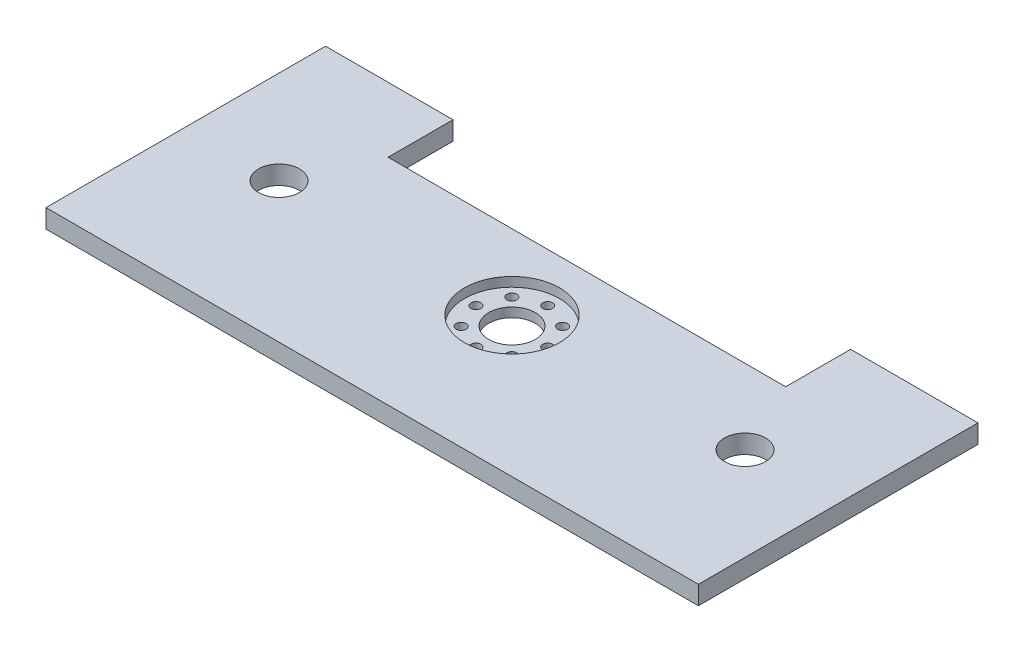
ISO-10303-21;
HEADER;
FILE_DESCRIPTION(('STEP AP214'),'2;1');
FILE_NAME('part.step','',(''),(''),'','','');
FILE_SCHEMA(('AUTOMOTIVE_DESIGN { 1 0 10303 214 1 1 1 1 }'));
ENDSEC;
DATA;
#1=APPLICATION_CONTEXT('core data for automotive mechanical design processes');
#2=APPLICATION_PROTOCOL_DEFINITION('international standard','automotive_design',2000,#1);
#3=PRODUCT_CONTEXT('',#1,'mechanical');
#4=PRODUCT('Part','Part','',(#3));
#5=PRODUCT_RELATED_PRODUCT_CATEGORY('part','',(#4));
#6=PRODUCT_DEFINITION_FORMATION('','',#4);
#7=PRODUCT_DEFINITION_CONTEXT('part definition',#1,'design');
#8=PRODUCT_DEFINITION('design','',#6,#7);
#9=PRODUCT_DEFINITION_SHAPE('','',#8);
#10=(LENGTH_UNIT() NAMED_UNIT(*) SI_UNIT(.MILLI.,.METRE.));
#11=(NAMED_UNIT(*) PLANE_ANGLE_UNIT() SI_UNIT($,.RADIAN.));
#12=(NAMED_UNIT(*) SI_UNIT($,.STERADIAN.) SOLID_ANGLE_UNIT());
#13=UNCERTAINTY_MEASURE_WITH_UNIT(LENGTH_MEASURE(1.E-05),#10,'distance_accuracy_value','');
#14=(GEOMETRIC_REPRESENTATION_CONTEXT(3) GLOBAL_UNCERTAINTY_ASSIGNED_CONTEXT((#13)) GLOBAL_UNIT_ASSIGNED_CONTEXT((#10,
#11,#12)) REPRESENTATION_CONTEXT('',''));
#15=CARTESIAN_POINT('',(0.,0.,0.));
#16=DIRECTION('',(0.,0.,1.));
#17=DIRECTION('',(1.,0.,0.));
#18=AXIS2_PLACEMENT_3D('',#15,#16,#17);
#19=CARTESIAN_POINT('',(0.,5.08,0.));
#20=DIRECTION('',(0.,1.,0.));
#21=DIRECTION('',(0.,0.,1.));
#22=AXIS2_PLACEMENT_3D('',#19,#20,#21);
#23=PLANE('',#22);
#24=CARTESIAN_POINT('',(0.,5.08,0.));
#25=DIRECTION('',(0.,1.,0.));
#26=DIRECTION('',(0.,0.,1.));
#27=AXIS2_PLACEMENT_3D('',#24,#25,#26);
#28=CIRCLE('',#27,12.954);
#29=CARTESIAN_POINT('',(0.,5.08,12.954));
#30=VERTEX_POINT('',#29);
#31=EDGE_CURVE('E196',#30,#30,#28,.T.);
#32=ORIENTED_EDGE('',*,*,#31,.F.);
#33=EDGE_LOOP('',(#32));
#34=FACE_BOUND('',#33,.T.);
#35=CARTESIAN_POINT('',(-63.5,5.08,0.));
#36=DIRECTION('',(0.,1.,0.));
#37=DIRECTION('',(0.,0.,1.));
#38=AXIS2_PLACEMENT_3D('',#35,#36,#37);
#39=CIRCLE('',#38,5.58799999999999);
#40=CARTESIAN_POINT('',(-63.5,5.08,5.58799999999999));
#41=VERTEX_POINT('',#40);
#42=EDGE_CURVE('E205',#41,#41,#39,.T.);
#43=ORIENTED_EDGE('',*,*,#42,.F.);
#44=EDGE_LOOP('',(#43));
#45=FACE_BOUND('',#44,.T.);
#46=CARTESIAN_POINT('',(63.5,5.08,0.));
#47=DIRECTION('',(0.,1.,0.));
#48=DIRECTION('',(0.,0.,1.));
#49=AXIS2_PLACEMENT_3D('',#46,#47,#48);
#50=CIRCLE('',#49,5.58799999999999);
#51=CARTESIAN_POINT('',(63.5,5.08,5.58799999999999));
#52=VERTEX_POINT('',#51);
#53=EDGE_CURVE('E199',#52,#52,#50,.T.);
#54=ORIENTED_EDGE('',*,*,#53,.F.);
#55=EDGE_LOOP('',(#54));
#56=FACE_BOUND('',#55,.T.);
#57=DIRECTION('',(1.,0.,0.));
#58=VECTOR('',#57,1.);
#59=CARTESIAN_POINT('',(54.1798398861406,5.08,-20.408634654288));
#60=LINE('',#59,#58);
#61=CARTESIAN_POINT('',(-54.1798398861406,5.08,-20.408634654288));
#62=VERTEX_POINT('',#61);
#63=CARTESIAN_POINT('',(54.1798398861406,5.08,-20.408634654288));
#64=VERTEX_POINT('',#63);
#65=EDGE_CURVE('E120',#62,#64,#60,.T.);
#66=ORIENTED_EDGE('',*,*,#65,.F.);
#67=DIRECTION('',(0.,0.,1.));
#68=VECTOR('',#67,1.);
#69=CARTESIAN_POINT('',(-54.1798398861406,5.08,-20.408634654288));
#70=LINE('',#69,#68);
#71=CARTESIAN_POINT('',(-54.1798398861406,5.08,-38.1));
#72=VERTEX_POINT('',#71);
#73=EDGE_CURVE('E111',#72,#62,#70,.T.);
#74=ORIENTED_EDGE('',*,*,#73,.F.);
#75=DIRECTION('',(-1.,0.,0.));
#76=VECTOR('',#75,1.);
#77=CARTESIAN_POINT('',(-88.9,5.08,-38.1));
#78=LINE('',#77,#76);
#79=CARTESIAN_POINT('',(-88.9,5.08,-38.1));
#80=VERTEX_POINT('',#79);
#81=EDGE_CURVE('E213',#72,#80,#78,.T.);
#82=ORIENTED_EDGE('',*,*,#81,.T.);
#83=DIRECTION('',(0.,0.,1.));
#84=VECTOR('',#83,1.);
#85=CARTESIAN_POINT('',(-88.9,5.08,-38.1));
#86=LINE('',#85,#84);
#87=CARTESIAN_POINT('',(-88.9,5.08,38.1));
#88=VERTEX_POINT('',#87);
#89=EDGE_CURVE('E215',#80,#88,#86,.T.);
#90=ORIENTED_EDGE('',*,*,#89,.T.);
#91=DIRECTION('',(1.,0.,0.));
#92=VECTOR('',#91,1.);
#93=CARTESIAN_POINT('',(-88.9,5.08,38.1));
#94=LINE('',#93,#92);
#95=CARTESIAN_POINT('',(88.9,5.08,38.1));
#96=VERTEX_POINT('',#95);
#97=EDGE_CURVE('E60',#88,#96,#94,.T.);
#98=ORIENTED_EDGE('',*,*,#97,.T.);
#99=DIRECTION('',(0.,0.,-1.));
#100=VECTOR('',#99,1.);
#101=CARTESIAN_POINT('',(88.9,5.08,-38.1));
#102=LINE('',#101,#100);
#103=CARTESIAN_POINT('',(88.9,5.08,-38.1));
#104=VERTEX_POINT('',#103);
#105=EDGE_CURVE('E211',#96,#104,#102,.T.);
#106=ORIENTED_EDGE('',*,*,#105,.T.);
#107=CARTESIAN_POINT('',(54.1798398861406,5.08,-38.1));
#108=VERTEX_POINT('',#107);
#109=EDGE_CURVE('E87',#104,#108,#78,.T.);
#110=ORIENTED_EDGE('',*,*,#109,.T.);
#111=DIRECTION('',(0.,0.,-1.));
#112=VECTOR('',#111,1.);
#113=CARTESIAN_POINT('',(54.1798398861406,5.08,-20.408634654288));
#114=LINE('',#113,#112);
#115=EDGE_CURVE('E51',#64,#108,#114,.T.);
#116=ORIENTED_EDGE('',*,*,#115,.F.);
#117=EDGE_LOOP('',(#66,#74,#82,#90,#98,#106,#110,#116));
#118=FACE_BOUND('',#117,.T.);
#119=ADVANCED_FACE('F35',(#34,#45,#56,#118),#23,.T.);
#120=CARTESIAN_POINT('',(0.,0.,0.));
#121=DIRECTION('',(0.,1.,0.));
#122=DIRECTION('',(0.,0.,1.));
#123=AXIS2_PLACEMENT_3D('',#120,#121,#122);
#124=PLANE('',#123);
#125=CARTESIAN_POINT('',(63.5,0.,0.));
#126=DIRECTION('',(0.,1.,0.));
#127=DIRECTION('',(0.,0.,1.));
#128=AXIS2_PLACEMENT_3D('',#125,#126,#127);
#129=CIRCLE('',#128,5.58799999999999);
#130=CARTESIAN_POINT('',(63.5,0.,5.58799999999999));
#131=VERTEX_POINT('',#130);
#132=EDGE_CURVE('E195',#131,#131,#129,.T.);
#133=ORIENTED_EDGE('',*,*,#132,.T.);
#134=EDGE_LOOP('',(#133));
#135=FACE_BOUND('',#134,.T.);
#136=CARTESIAN_POINT('',(-63.5,0.,0.));
#137=DIRECTION('',(0.,1.,0.));
#138=DIRECTION('',(0.,0.,1.));
#139=AXIS2_PLACEMENT_3D('',#136,#137,#138);
#140=CIRCLE('',#139,5.58799999999999);
#141=CARTESIAN_POINT('',(-63.5,0.,5.58799999999999));
#142=VERTEX_POINT('',#141);
#143=EDGE_CURVE('E202',#142,#142,#140,.T.);
#144=ORIENTED_EDGE('',*,*,#143,.T.);
#145=EDGE_LOOP('',(#144));
#146=FACE_BOUND('',#145,.T.);
#147=CARTESIAN_POINT('',(0.,0.,0.));
#148=DIRECTION('',(0.,1.,0.));
#149=DIRECTION('',(0.,0.,1.));
#150=AXIS2_PLACEMENT_3D('',#147,#148,#149);
#151=CIRCLE('',#150,6.35);
#152=CARTESIAN_POINT('',(0.,0.,6.35));
#153=VERTEX_POINT('',#152);
#154=EDGE_CURVE('E189',#153,#153,#151,.T.);
#155=ORIENTED_EDGE('',*,*,#154,.T.);
#156=EDGE_LOOP('',(#155));
#157=FACE_BOUND('',#156,.T.);
#158=CARTESIAN_POINT('',(0.0657403354153976,0.,9.88724751288396));
#159=DIRECTION('',(0.,1.,0.));
#160=DIRECTION('',(0.,0.,1.));
#161=AXIS2_PLACEMENT_3D('',#158,#159,#160);
#162=CIRCLE('',#161,1.35254999999999);
#163=CARTESIAN_POINT('',(0.0657403354153976,0.,11.2397975128839));
#164=VERTEX_POINT('',#163);
#165=EDGE_CURVE('E186',#164,#164,#162,.T.);
#166=ORIENTED_EDGE('',*,*,#165,.T.);
#167=EDGE_LOOP('',(#166));
#168=FACE_BOUND('',#167,.T.);
#169=CARTESIAN_POINT('',(-6.84905687780786,0.,7.0230447261072));
#170=DIRECTION('',(0.,1.,0.));
#171=DIRECTION('',(0.,0.,1.));
#172=AXIS2_PLACEMENT_3D('',#169,#170,#171);
#173=CIRCLE('',#172,1.35254999999999);
#174=CARTESIAN_POINT('',(-6.84905687780786,0.,8.37559472610719));
#175=VERTEX_POINT('',#174);
#176=EDGE_CURVE('E180',#175,#175,#173,.T.);
#177=ORIENTED_EDGE('',*,*,#176,.T.);
#178=EDGE_LOOP('',(#177));
#179=FACE_BOUND('',#178,.T.);
#180=CARTESIAN_POINT('',(-9.7132596645846,0.,0.108247512883929));
#181=DIRECTION('',(0.,1.,0.));
#182=DIRECTION('',(0.,0.,1.));
#183=AXIS2_PLACEMENT_3D('',#180,#181,#182);
#184=CIRCLE('',#183,1.35254999999999);
#185=CARTESIAN_POINT('',(-9.7132596645846,0.,1.46079751288392));
#186=VERTEX_POINT('',#185);
#187=EDGE_CURVE('E174',#186,#186,#184,.T.);
#188=ORIENTED_EDGE('',*,*,#187,.T.);
#189=EDGE_LOOP('',(#188));
#190=FACE_BOUND('',#189,.T.);
#191=CARTESIAN_POINT('',(-6.84905687780781,0.,-6.80654970033932));
#192=DIRECTION('',(0.,1.,0.));
#193=DIRECTION('',(0.,0.,1.));
#194=AXIS2_PLACEMENT_3D('',#191,#192,#193);
#195=CIRCLE('',#194,1.35254999999999);
#196=CARTESIAN_POINT('',(-6.84905687780781,0.,-5.45399970033933));
#197=VERTEX_POINT('',#196);
#198=EDGE_CURVE('E168',#197,#197,#195,.T.);
#199=ORIENTED_EDGE('',*,*,#198,.T.);
#200=EDGE_LOOP('',(#199));
#201=FACE_BOUND('',#200,.T.);
#202=CARTESIAN_POINT('',(0.0657403354154661,0.,-9.67075248711604));
#203=DIRECTION('',(0.,1.,0.));
#204=DIRECTION('',(0.,0.,1.));
#205=AXIS2_PLACEMENT_3D('',#202,#203,#204);
#206=CIRCLE('',#205,1.35254999999999);
#207=CARTESIAN_POINT('',(0.0657403354154661,0.,-8.31820248711605));
#208=VERTEX_POINT('',#207);
#209=EDGE_CURVE('E162',#208,#208,#206,.T.);
#210=ORIENTED_EDGE('',*,*,#209,.T.);
#211=EDGE_LOOP('',(#210));
#212=FACE_BOUND('',#211,.T.);
#213=CARTESIAN_POINT('',(6.98053754863856,0.,7.02304472610729));
#214=DIRECTION('',(0.,1.,0.));
#215=DIRECTION('',(0.,0.,1.));
#216=AXIS2_PLACEMENT_3D('',#213,#214,#215);
#217=CIRCLE('',#216,1.35254999999999);
#218=CARTESIAN_POINT('',(6.98053754863856,0.,8.37559472610728));
#219=VERTEX_POINT('',#218);
#220=EDGE_CURVE('E156',#219,#219,#217,.T.);
#221=ORIENTED_EDGE('',*,*,#220,.T.);
#222=EDGE_LOOP('',(#221));
#223=FACE_BOUND('',#222,.T.);
#224=CARTESIAN_POINT('',(9.8447403354154,0.,0.108247512884066));
#225=DIRECTION('',(0.,1.,0.));
#226=DIRECTION('',(0.,0.,1.));
#227=AXIS2_PLACEMENT_3D('',#224,#225,#226);
#228=CIRCLE('',#227,1.35254999999999);
#229=CARTESIAN_POINT('',(9.8447403354154,0.,1.46079751288405));
#230=VERTEX_POINT('',#229);
#231=EDGE_CURVE('E150',#230,#230,#228,.T.);
#232=ORIENTED_EDGE('',*,*,#231,.T.);
#233=EDGE_LOOP('',(#232));
#234=FACE_BOUND('',#233,.T.);
#235=CARTESIAN_POINT('',(6.98053754863871,0.,-6.80654970033923));
#236=DIRECTION('',(0.,1.,0.));
#237=DIRECTION('',(0.,0.,1.));
#238=AXIS2_PLACEMENT_3D('',#235,#236,#237);
#239=CIRCLE('',#238,1.35254999999999);
#240=CARTESIAN_POINT('',(6.98053754863871,0.,-5.45399970033924));
#241=VERTEX_POINT('',#240);
#242=EDGE_CURVE('E144',#241,#241,#239,.T.);
#243=ORIENTED_EDGE('',*,*,#242,.T.);
#244=EDGE_LOOP('',(#243));
#245=FACE_BOUND('',#244,.T.);
#246=DIRECTION('',(0.,0.,1.));
#247=VECTOR('',#246,1.);
#248=CARTESIAN_POINT('',(-54.1798398861406,0.,-20.408634654288));
#249=LINE('',#248,#247);
#250=CARTESIAN_POINT('',(-54.1798398861406,0.,-38.1));
#251=VERTEX_POINT('',#250);
#252=CARTESIAN_POINT('',(-54.1798398861406,0.,-20.408634654288));
#253=VERTEX_POINT('',#252);
#254=EDGE_CURVE('E133',#251,#253,#249,.T.);
#255=ORIENTED_EDGE('',*,*,#254,.T.);
#256=DIRECTION('',(1.,0.,0.));
#257=VECTOR('',#256,1.);
#258=CARTESIAN_POINT('',(54.1798398861406,0.,-20.408634654288));
#259=LINE('',#258,#257);
#260=CARTESIAN_POINT('',(54.1798398861406,0.,-20.408634654288));
#261=VERTEX_POINT('',#260);
#262=EDGE_CURVE('E126',#253,#261,#259,.T.);
#263=ORIENTED_EDGE('',*,*,#262,.T.);
#264=DIRECTION('',(0.,0.,-1.));
#265=VECTOR('',#264,1.);
#266=CARTESIAN_POINT('',(54.1798398861406,0.,-20.408634654288));
#267=LINE('',#266,#265);
#268=CARTESIAN_POINT('',(54.1798398861406,0.,-38.1));
#269=VERTEX_POINT('',#268);
#270=EDGE_CURVE('E121',#261,#269,#267,.T.);
#271=ORIENTED_EDGE('',*,*,#270,.T.);
#272=DIRECTION('',(-1.,0.,0.));
#273=VECTOR('',#272,1.);
#274=CARTESIAN_POINT('',(-88.9,0.,-38.1));
#275=LINE('',#274,#273);
#276=CARTESIAN_POINT('',(88.9,0.,-38.1));
#277=VERTEX_POINT('',#276);
#278=EDGE_CURVE('E222',#277,#269,#275,.T.);
#279=ORIENTED_EDGE('',*,*,#278,.F.);
#280=DIRECTION('',(0.,0.,-1.));
#281=VECTOR('',#280,1.);
#282=CARTESIAN_POINT('',(88.9,0.,-38.1));
#283=LINE('',#282,#281);
#284=CARTESIAN_POINT('',(88.9,0.,38.1));
#285=VERTEX_POINT('',#284);
#286=EDGE_CURVE('E208',#285,#277,#283,.T.);
#287=ORIENTED_EDGE('',*,*,#286,.F.);
#288=DIRECTION('',(1.,0.,0.));
#289=VECTOR('',#288,1.);
#290=CARTESIAN_POINT('',(-88.9,0.,38.1));
#291=LINE('',#290,#289);
#292=CARTESIAN_POINT('',(-88.9,0.,38.1));
#293=VERTEX_POINT('',#292);
#294=EDGE_CURVE('E81',#293,#285,#291,.T.);
#295=ORIENTED_EDGE('',*,*,#294,.F.);
#296=DIRECTION('',(0.,0.,1.));
#297=VECTOR('',#296,1.);
#298=CARTESIAN_POINT('',(-88.9,0.,-38.1));
#299=LINE('',#298,#297);
#300=CARTESIAN_POINT('',(-88.9,0.,-38.1));
#301=VERTEX_POINT('',#300);
#302=EDGE_CURVE('E225',#301,#293,#299,.T.);
#303=ORIENTED_EDGE('',*,*,#302,.F.);
#304=EDGE_CURVE('E221',#251,#301,#275,.T.);
#305=ORIENTED_EDGE('',*,*,#304,.F.);
#306=EDGE_LOOP('',(#255,#263,#271,#279,#287,#295,#303,#305));
#307=FACE_BOUND('',#306,.T.);
#308=ADVANCED_FACE('F241',(#135,#146,#157,#168,#179,#190,#201,#212,#223,#234,#245,#307),#124,.F.);
#309=CARTESIAN_POINT('',(-88.9,5.08,-38.1));
#310=DIRECTION('',(0.,0.,1.));
#311=DIRECTION('',(1.,0.,0.));
#312=AXIS2_PLACEMENT_3D('',#309,#310,#311);
#313=PLANE('',#312);
#314=DIRECTION('',(0.,-1.,0.));
#315=VECTOR('',#314,1.);
#316=CARTESIAN_POINT('',(-54.1798398861406,5.08,-38.1));
#317=LINE('',#316,#315);
#318=EDGE_CURVE('E117',#72,#251,#317,.T.);
#319=ORIENTED_EDGE('',*,*,#318,.T.);
#320=ORIENTED_EDGE('',*,*,#304,.T.);
#321=DIRECTION('',(0.,-1.,0.));
#322=VECTOR('',#321,1.);
#323=CARTESIAN_POINT('',(-88.9,5.08,-38.1));
#324=LINE('',#323,#322);
#325=EDGE_CURVE('E44',#80,#301,#324,.T.);
#326=ORIENTED_EDGE('',*,*,#325,.F.);
#327=ORIENTED_EDGE('',*,*,#81,.F.);
#328=EDGE_LOOP('',(#319,#320,#326,#327));
#329=FACE_BOUND('',#328,.T.);
#330=ADVANCED_FACE('F265',(#329),#313,.F.);
#331=DIRECTION('',(0.,-1.,0.));
#332=VECTOR('',#331,1.);
#333=CARTESIAN_POINT('',(54.1798398861406,5.08,-38.1));
#334=LINE('',#333,#332);
#335=EDGE_CURVE('E139',#108,#269,#334,.T.);
#336=ORIENTED_EDGE('',*,*,#335,.F.);
#337=ORIENTED_EDGE('',*,*,#109,.F.);
#338=DIRECTION('',(0.,-1.,0.));
#339=VECTOR('',#338,1.);
#340=CARTESIAN_POINT('',(88.9,5.08,-38.1));
#341=LINE('',#340,#339);
#342=EDGE_CURVE('E11',#104,#277,#341,.T.);
#343=ORIENTED_EDGE('',*,*,#342,.T.);
#344=ORIENTED_EDGE('',*,*,#278,.T.);
#345=EDGE_LOOP('',(#336,#337,#343,#344));
#346=FACE_BOUND('',#345,.T.);
#347=ADVANCED_FACE('F327',(#346),#313,.F.);
#348=CARTESIAN_POINT('',(88.9,5.08,-38.1));
#349=DIRECTION('',(-1.,0.,0.));
#350=DIRECTION('',(0.,0.,1.));
#351=AXIS2_PLACEMENT_3D('',#348,#349,#350);
#352=PLANE('',#351);
#353=ORIENTED_EDGE('',*,*,#286,.T.);
#354=ORIENTED_EDGE('',*,*,#342,.F.);
#355=ORIENTED_EDGE('',*,*,#105,.F.);
#356=DIRECTION('',(0.,-1.,0.));
#357=VECTOR('',#356,1.);
#358=CARTESIAN_POINT('',(88.9,5.08,38.1));
#359=LINE('',#358,#357);
#360=EDGE_CURVE('E218',#96,#285,#359,.T.);
#361=ORIENTED_EDGE('',*,*,#360,.T.);
#362=EDGE_LOOP('',(#353,#354,#355,#361));
#363=FACE_BOUND('',#362,.T.);
#364=ADVANCED_FACE('F37',(#363),#352,.F.);
#365=CARTESIAN_POINT('',(-88.9,5.08,-38.1));
#366=DIRECTION('',(1.,0.,0.));
#367=DIRECTION('',(0.,0.,-1.));
#368=AXIS2_PLACEMENT_3D('',#365,#366,#367);
#369=PLANE('',#368);
#370=ORIENTED_EDGE('',*,*,#302,.T.);
#371=DIRECTION('',(0.,-1.,0.));
#372=VECTOR('',#371,1.);
#373=CARTESIAN_POINT('',(-88.9,5.08,38.1));
#374=LINE('',#373,#372);
#375=EDGE_CURVE('E229',#88,#293,#374,.T.);
#376=ORIENTED_EDGE('',*,*,#375,.F.);
#377=ORIENTED_EDGE('',*,*,#89,.F.);
#378=ORIENTED_EDGE('',*,*,#325,.T.);
#379=EDGE_LOOP('',(#370,#376,#377,#378));
#380=FACE_BOUND('',#379,.T.);
#381=ADVANCED_FACE('F236',(#380),#369,.F.);
#382=CARTESIAN_POINT('',(-88.9,5.08,38.1));
#383=DIRECTION('',(0.,0.,-1.));
#384=DIRECTION('',(-1.,0.,0.));
#385=AXIS2_PLACEMENT_3D('',#382,#383,#384);
#386=PLANE('',#385);
#387=ORIENTED_EDGE('',*,*,#294,.T.);
#388=ORIENTED_EDGE('',*,*,#360,.F.);
#389=ORIENTED_EDGE('',*,*,#97,.F.);
#390=ORIENTED_EDGE('',*,*,#375,.T.);
#391=EDGE_LOOP('',(#387,#388,#389,#390));
#392=FACE_BOUND('',#391,.T.);
#393=ADVANCED_FACE('F246',(#392),#386,.F.);
#394=CARTESIAN_POINT('',(-63.5,5.08,0.));
#395=DIRECTION('',(0.,-1.,0.));
#396=DIRECTION('',(0.,0.,-1.));
#397=AXIS2_PLACEMENT_3D('',#394,#395,#396);
#398=CYLINDRICAL_SURFACE('',#397,5.58799999999999);
#399=ORIENTED_EDGE('',*,*,#42,.T.);
#400=EDGE_LOOP('',(#399));
#401=FACE_BOUND('',#400,.T.);
#402=ORIENTED_EDGE('',*,*,#143,.F.);
#403=EDGE_LOOP('',(#402));
#404=FACE_BOUND('',#403,.T.);
#405=ADVANCED_FACE('F248',(#401,#404),#398,.F.);
#406=CARTESIAN_POINT('',(63.5,5.08,0.));
#407=DIRECTION('',(0.,-1.,0.));
#408=DIRECTION('',(0.,0.,-1.));
#409=AXIS2_PLACEMENT_3D('',#406,#407,#408);
#410=CYLINDRICAL_SURFACE('',#409,5.58799999999999);
#411=ORIENTED_EDGE('',*,*,#53,.T.);
#412=EDGE_LOOP('',(#411));
#413=FACE_BOUND('',#412,.T.);
#414=ORIENTED_EDGE('',*,*,#132,.F.);
#415=EDGE_LOOP('',(#414));
#416=FACE_BOUND('',#415,.T.);
#417=ADVANCED_FACE('F254',(#413,#416),#410,.F.);
#418=CARTESIAN_POINT('',(0.,2.54,0.));
#419=DIRECTION('',(0.,1.,0.));
#420=DIRECTION('',(0.,0.,1.));
#421=AXIS2_PLACEMENT_3D('',#418,#419,#420);
#422=CYLINDRICAL_SURFACE('',#421,12.954);
#423=CARTESIAN_POINT('',(0.,2.54,0.));
#424=DIRECTION('',(0.,1.,0.));
#425=DIRECTION('',(0.,0.,1.));
#426=AXIS2_PLACEMENT_3D('',#423,#424,#425);
#427=CIRCLE('',#426,12.954);
#428=CARTESIAN_POINT('',(0.,2.54,12.954));
#429=VERTEX_POINT('',#428);
#430=EDGE_CURVE('E192',#429,#429,#427,.T.);
#431=ORIENTED_EDGE('',*,*,#430,.F.);
#432=EDGE_LOOP('',(#431));
#433=FACE_BOUND('',#432,.T.);
#434=ORIENTED_EDGE('',*,*,#31,.T.);
#435=EDGE_LOOP('',(#434));
#436=FACE_BOUND('',#435,.T.);
#437=ADVANCED_FACE('F272',(#433,#436),#422,.F.);
#438=CARTESIAN_POINT('',(0.,2.54,0.));
#439=DIRECTION('',(0.,1.,0.));
#440=DIRECTION('',(0.,0.,1.));
#441=AXIS2_PLACEMENT_3D('',#438,#439,#440);
#442=PLANE('',#441);
#443=CARTESIAN_POINT('',(6.98053754863871,2.54,-6.80654970033923));
#444=DIRECTION('',(0.,1.,0.));
#445=DIRECTION('',(0.,0.,1.));
#446=AXIS2_PLACEMENT_3D('',#443,#444,#445);
#447=CIRCLE('',#446,1.35254999999999);
#448=CARTESIAN_POINT('',(6.98053754863871,2.54,-5.45399970033924));
#449=VERTEX_POINT('',#448);
#450=EDGE_CURVE('E127',#449,#449,#447,.T.);
#451=ORIENTED_EDGE('',*,*,#450,.F.);
#452=EDGE_LOOP('',(#451));
#453=FACE_BOUND('',#452,.T.);
#454=CARTESIAN_POINT('',(9.8447403354154,2.54,0.108247512884066));
#455=DIRECTION('',(0.,1.,0.));
#456=DIRECTION('',(0.,0.,1.));
#457=AXIS2_PLACEMENT_3D('',#454,#455,#456);
#458=CIRCLE('',#457,1.35254999999999);
#459=CARTESIAN_POINT('',(9.8447403354154,2.54,1.46079751288405));
#460=VERTEX_POINT('',#459);
#461=EDGE_CURVE('E147',#460,#460,#458,.T.);
#462=ORIENTED_EDGE('',*,*,#461,.F.);
#463=EDGE_LOOP('',(#462));
#464=FACE_BOUND('',#463,.T.);
#465=CARTESIAN_POINT('',(6.98053754863856,2.54,7.02304472610729));
#466=DIRECTION('',(0.,1.,0.));
#467=DIRECTION('',(0.,0.,1.));
#468=AXIS2_PLACEMENT_3D('',#465,#466,#467);
#469=CIRCLE('',#468,1.35254999999999);
#470=CARTESIAN_POINT('',(6.98053754863856,2.54,8.37559472610728));
#471=VERTEX_POINT('',#470);
#472=EDGE_CURVE('E153',#471,#471,#469,.T.);
#473=ORIENTED_EDGE('',*,*,#472,.F.);
#474=EDGE_LOOP('',(#473));
#475=FACE_BOUND('',#474,.T.);
#476=CARTESIAN_POINT('',(0.0657403354154661,2.54,-9.67075248711604));
#477=DIRECTION('',(0.,1.,0.));
#478=DIRECTION('',(0.,0.,1.));
#479=AXIS2_PLACEMENT_3D('',#476,#477,#478);
#480=CIRCLE('',#479,1.35254999999999);
#481=CARTESIAN_POINT('',(0.0657403354154661,2.54,-8.31820248711605));
#482=VERTEX_POINT('',#481);
#483=EDGE_CURVE('E159',#482,#482,#480,.T.);
#484=ORIENTED_EDGE('',*,*,#483,.F.);
#485=EDGE_LOOP('',(#484));
#486=FACE_BOUND('',#485,.T.);
#487=CARTESIAN_POINT('',(-6.84905687780781,2.54,-6.80654970033932));
#488=DIRECTION('',(0.,1.,0.));
#489=DIRECTION('',(0.,0.,1.));
#490=AXIS2_PLACEMENT_3D('',#487,#488,#489);
#491=CIRCLE('',#490,1.35254999999999);
#492=CARTESIAN_POINT('',(-6.84905687780781,2.54,-5.45399970033933));
#493=VERTEX_POINT('',#492);
#494=EDGE_CURVE('E165',#493,#493,#491,.T.);
#495=ORIENTED_EDGE('',*,*,#494,.F.);
#496=EDGE_LOOP('',(#495));
#497=FACE_BOUND('',#496,.T.);
#498=CARTESIAN_POINT('',(-9.7132596645846,2.54,0.108247512883929));
#499=DIRECTION('',(0.,1.,0.));
#500=DIRECTION('',(0.,0.,1.));
#501=AXIS2_PLACEMENT_3D('',#498,#499,#500);
#502=CIRCLE('',#501,1.35254999999999);
#503=CARTESIAN_POINT('',(-9.7132596645846,2.54,1.46079751288392));
#504=VERTEX_POINT('',#503);
#505=EDGE_CURVE('E171',#504,#504,#502,.T.);
#506=ORIENTED_EDGE('',*,*,#505,.F.);
#507=EDGE_LOOP('',(#506));
#508=FACE_BOUND('',#507,.T.);
#509=CARTESIAN_POINT('',(-6.84905687780786,2.54,7.0230447261072));
#510=DIRECTION('',(0.,1.,0.));
#511=DIRECTION('',(0.,0.,1.));
#512=AXIS2_PLACEMENT_3D('',#509,#510,#511);
#513=CIRCLE('',#512,1.35254999999999);
#514=CARTESIAN_POINT('',(-6.84905687780786,2.54,8.37559472610719));
#515=VERTEX_POINT('',#514);
#516=EDGE_CURVE('E177',#515,#515,#513,.T.);
#517=ORIENTED_EDGE('',*,*,#516,.F.);
#518=EDGE_LOOP('',(#517));
#519=FACE_BOUND('',#518,.T.);
#520=CARTESIAN_POINT('',(0.0657403354153976,2.54,9.88724751288396));
#521=DIRECTION('',(0.,1.,0.));
#522=DIRECTION('',(0.,0.,1.));
#523=AXIS2_PLACEMENT_3D('',#520,#521,#522);
#524=CIRCLE('',#523,1.35254999999999);
#525=CARTESIAN_POINT('',(0.0657403354153976,2.54,11.2397975128839));
#526=VERTEX_POINT('',#525);
#527=EDGE_CURVE('E183',#526,#526,#524,.T.);
#528=ORIENTED_EDGE('',*,*,#527,.F.);
#529=EDGE_LOOP('',(#528));
#530=FACE_BOUND('',#529,.T.);
#531=CARTESIAN_POINT('',(0.,2.54,0.));
#532=DIRECTION('',(0.,1.,0.));
#533=DIRECTION('',(0.,0.,1.));
#534=AXIS2_PLACEMENT_3D('',#531,#532,#533);
#535=CIRCLE('',#534,6.35);
#536=CARTESIAN_POINT('',(0.,2.54,6.35));
#537=VERTEX_POINT('',#536);
#538=EDGE_CURVE('E39',#537,#537,#535,.T.);
#539=ORIENTED_EDGE('',*,*,#538,.F.);
#540=EDGE_LOOP('',(#539));
#541=FACE_BOUND('',#540,.T.);
#542=ORIENTED_EDGE('',*,*,#430,.T.);
#543=EDGE_LOOP('',(#542));
#544=FACE_BOUND('',#543,.T.);
#545=ADVANCED_FACE('F276',(#453,#464,#475,#486,#497,#508,#519,#530,#541,#544),#442,.T.);
#546=CARTESIAN_POINT('',(0.,0.,0.));
#547=DIRECTION('',(0.,1.,0.));
#548=DIRECTION('',(0.,0.,1.));
#549=AXIS2_PLACEMENT_3D('',#546,#547,#548);
#550=CYLINDRICAL_SURFACE('',#549,6.35);
#551=ORIENTED_EDGE('',*,*,#538,.T.);
#552=EDGE_LOOP('',(#551));
#553=FACE_BOUND('',#552,.T.);
#554=ORIENTED_EDGE('',*,*,#154,.F.);
#555=EDGE_LOOP('',(#554));
#556=FACE_BOUND('',#555,.T.);
#557=ADVANCED_FACE('F280',(#553,#556),#550,.F.);
#558=CARTESIAN_POINT('',(0.0657403354153976,2.54,9.88724751288396));
#559=DIRECTION('',(0.,1.,0.));
#560=DIRECTION('',(0.,0.,1.));
#561=AXIS2_PLACEMENT_3D('',#558,#559,#560);
#562=CYLINDRICAL_SURFACE('',#561,1.35254999999999);
#563=ORIENTED_EDGE('',*,*,#165,.F.);
#564=EDGE_LOOP('',(#563));
#565=FACE_BOUND('',#564,.T.);
#566=ORIENTED_EDGE('',*,*,#527,.T.);
#567=EDGE_LOOP('',(#566));
#568=FACE_BOUND('',#567,.T.);
#569=ADVANCED_FACE('F284',(#565,#568),#562,.F.);
#570=CARTESIAN_POINT('',(-6.84905687780786,2.54,7.0230447261072));
#571=DIRECTION('',(0.,1.,0.));
#572=DIRECTION('',(0.,0.,1.));
#573=AXIS2_PLACEMENT_3D('',#570,#571,#572);
#574=CYLINDRICAL_SURFACE('',#573,1.35254999999999);
#575=ORIENTED_EDGE('',*,*,#176,.F.);
#576=EDGE_LOOP('',(#575));
#577=FACE_BOUND('',#576,.T.);
#578=ORIENTED_EDGE('',*,*,#516,.T.);
#579=EDGE_LOOP('',(#578));
#580=FACE_BOUND('',#579,.T.);
#581=ADVANCED_FACE('F288',(#577,#580),#574,.F.);
#582=CARTESIAN_POINT('',(-9.7132596645846,2.54,0.108247512883929));
#583=DIRECTION('',(0.,1.,0.));
#584=DIRECTION('',(0.,0.,1.));
#585=AXIS2_PLACEMENT_3D('',#582,#583,#584);
#586=CYLINDRICAL_SURFACE('',#585,1.35254999999999);
#587=ORIENTED_EDGE('',*,*,#187,.F.);
#588=EDGE_LOOP('',(#587));
#589=FACE_BOUND('',#588,.T.);
#590=ORIENTED_EDGE('',*,*,#505,.T.);
#591=EDGE_LOOP('',(#590));
#592=FACE_BOUND('',#591,.T.);
#593=ADVANCED_FACE('F292',(#589,#592),#586,.F.);
#594=CARTESIAN_POINT('',(-6.84905687780781,2.54,-6.80654970033932));
#595=DIRECTION('',(0.,1.,0.));
#596=DIRECTION('',(0.,0.,1.));
#597=AXIS2_PLACEMENT_3D('',#594,#595,#596);
#598=CYLINDRICAL_SURFACE('',#597,1.35254999999999);
#599=ORIENTED_EDGE('',*,*,#198,.F.);
#600=EDGE_LOOP('',(#599));
#601=FACE_BOUND('',#600,.T.);
#602=ORIENTED_EDGE('',*,*,#494,.T.);
#603=EDGE_LOOP('',(#602));
#604=FACE_BOUND('',#603,.T.);
#605=ADVANCED_FACE('F296',(#601,#604),#598,.F.);
#606=CARTESIAN_POINT('',(0.0657403354154661,2.54,-9.67075248711604));
#607=DIRECTION('',(0.,1.,0.));
#608=DIRECTION('',(0.,0.,1.));
#609=AXIS2_PLACEMENT_3D('',#606,#607,#608);
#610=CYLINDRICAL_SURFACE('',#609,1.35254999999999);
#611=ORIENTED_EDGE('',*,*,#209,.F.);
#612=EDGE_LOOP('',(#611));
#613=FACE_BOUND('',#612,.T.);
#614=ORIENTED_EDGE('',*,*,#483,.T.);
#615=EDGE_LOOP('',(#614));
#616=FACE_BOUND('',#615,.T.);
#617=ADVANCED_FACE('F300',(#613,#616),#610,.F.);
#618=CARTESIAN_POINT('',(6.98053754863856,2.54,7.02304472610729));
#619=DIRECTION('',(0.,1.,0.));
#620=DIRECTION('',(0.,0.,1.));
#621=AXIS2_PLACEMENT_3D('',#618,#619,#620);
#622=CYLINDRICAL_SURFACE('',#621,1.35254999999999);
#623=ORIENTED_EDGE('',*,*,#220,.F.);
#624=EDGE_LOOP('',(#623));
#625=FACE_BOUND('',#624,.T.);
#626=ORIENTED_EDGE('',*,*,#472,.T.);
#627=EDGE_LOOP('',(#626));
#628=FACE_BOUND('',#627,.T.);
#629=ADVANCED_FACE('F304',(#625,#628),#622,.F.);
#630=CARTESIAN_POINT('',(9.8447403354154,2.54,0.108247512884066));
#631=DIRECTION('',(0.,1.,0.));
#632=DIRECTION('',(0.,0.,1.));
#633=AXIS2_PLACEMENT_3D('',#630,#631,#632);
#634=CYLINDRICAL_SURFACE('',#633,1.35254999999999);
#635=ORIENTED_EDGE('',*,*,#231,.F.);
#636=EDGE_LOOP('',(#635));
#637=FACE_BOUND('',#636,.T.);
#638=ORIENTED_EDGE('',*,*,#461,.T.);
#639=EDGE_LOOP('',(#638));
#640=FACE_BOUND('',#639,.T.);
#641=ADVANCED_FACE('F308',(#637,#640),#634,.F.);
#642=CARTESIAN_POINT('',(6.98053754863871,2.54,-6.80654970033923));
#643=DIRECTION('',(0.,1.,0.));
#644=DIRECTION('',(0.,0.,1.));
#645=AXIS2_PLACEMENT_3D('',#642,#643,#644);
#646=CYLINDRICAL_SURFACE('',#645,1.35254999999999);
#647=ORIENTED_EDGE('',*,*,#242,.F.);
#648=EDGE_LOOP('',(#647));
#649=FACE_BOUND('',#648,.T.);
#650=ORIENTED_EDGE('',*,*,#450,.T.);
#651=EDGE_LOOP('',(#650));
#652=FACE_BOUND('',#651,.T.);
#653=ADVANCED_FACE('F312',(#649,#652),#646,.F.);
#654=CARTESIAN_POINT('',(-54.1798398861406,5.08,-20.408634654288));
#655=DIRECTION('',(1.,0.,0.));
#656=DIRECTION('',(0.,0.,-1.));
#657=AXIS2_PLACEMENT_3D('',#654,#655,#656);
#658=PLANE('',#657);
#659=ORIENTED_EDGE('',*,*,#254,.F.);
#660=ORIENTED_EDGE('',*,*,#318,.F.);
#661=ORIENTED_EDGE('',*,*,#73,.T.);
#662=DIRECTION('',(0.,-1.,0.));
#663=VECTOR('',#662,1.);
#664=CARTESIAN_POINT('',(-54.1798398861406,5.08,-20.408634654288));
#665=LINE('',#664,#663);
#666=EDGE_CURVE('E114',#62,#253,#665,.T.);
#667=ORIENTED_EDGE('',*,*,#666,.T.);
#668=EDGE_LOOP('',(#659,#660,#661,#667));
#669=FACE_BOUND('',#668,.T.);
#670=ADVANCED_FACE('F113',(#669),#658,.T.);
#671=CARTESIAN_POINT('',(54.1798398861406,5.08,-20.408634654288));
#672=DIRECTION('',(0.,0.,-1.));
#673=DIRECTION('',(-1.,0.,0.));
#674=AXIS2_PLACEMENT_3D('',#671,#672,#673);
#675=PLANE('',#674);
#676=ORIENTED_EDGE('',*,*,#262,.F.);
#677=ORIENTED_EDGE('',*,*,#666,.F.);
#678=ORIENTED_EDGE('',*,*,#65,.T.);
#679=DIRECTION('',(0.,-1.,0.));
#680=VECTOR('',#679,1.);
#681=CARTESIAN_POINT('',(54.1798398861406,5.08,-20.408634654288));
#682=LINE('',#681,#680);
#683=EDGE_CURVE('E128',#64,#261,#682,.T.);
#684=ORIENTED_EDGE('',*,*,#683,.T.);
#685=EDGE_LOOP('',(#676,#677,#678,#684));
#686=FACE_BOUND('',#685,.T.);
#687=ADVANCED_FACE('F124',(#686),#675,.T.);
#688=CARTESIAN_POINT('',(54.1798398861406,5.08,-20.408634654288));
#689=DIRECTION('',(-1.,0.,0.));
#690=DIRECTION('',(0.,0.,1.));
#691=AXIS2_PLACEMENT_3D('',#688,#689,#690);
#692=PLANE('',#691);
#693=ORIENTED_EDGE('',*,*,#270,.F.);
#694=ORIENTED_EDGE('',*,*,#683,.F.);
#695=ORIENTED_EDGE('',*,*,#115,.T.);
#696=ORIENTED_EDGE('',*,*,#335,.T.);
#697=EDGE_LOOP('',(#693,#694,#695,#696));
#698=FACE_BOUND('',#697,.T.);
#699=ADVANCED_FACE('F321',(#698),#692,.T.);
#700=CLOSED_SHELL('',(#119,#308,#330,#347,#364,#381,#393,#405,#417,#437,#545,#557,#569,#581,
#593,#605,#617,#629,#641,#653,#670,#687,#699));
#701=MANIFOLD_SOLID_BREP('B2',#700);
#702=ADVANCED_BREP_SHAPE_REPRESENTATION('',(#18,#701),#14);
#703=SHAPE_DEFINITION_REPRESENTATION(#9,#702);
ENDSEC;
END-ISO-10303-21;
